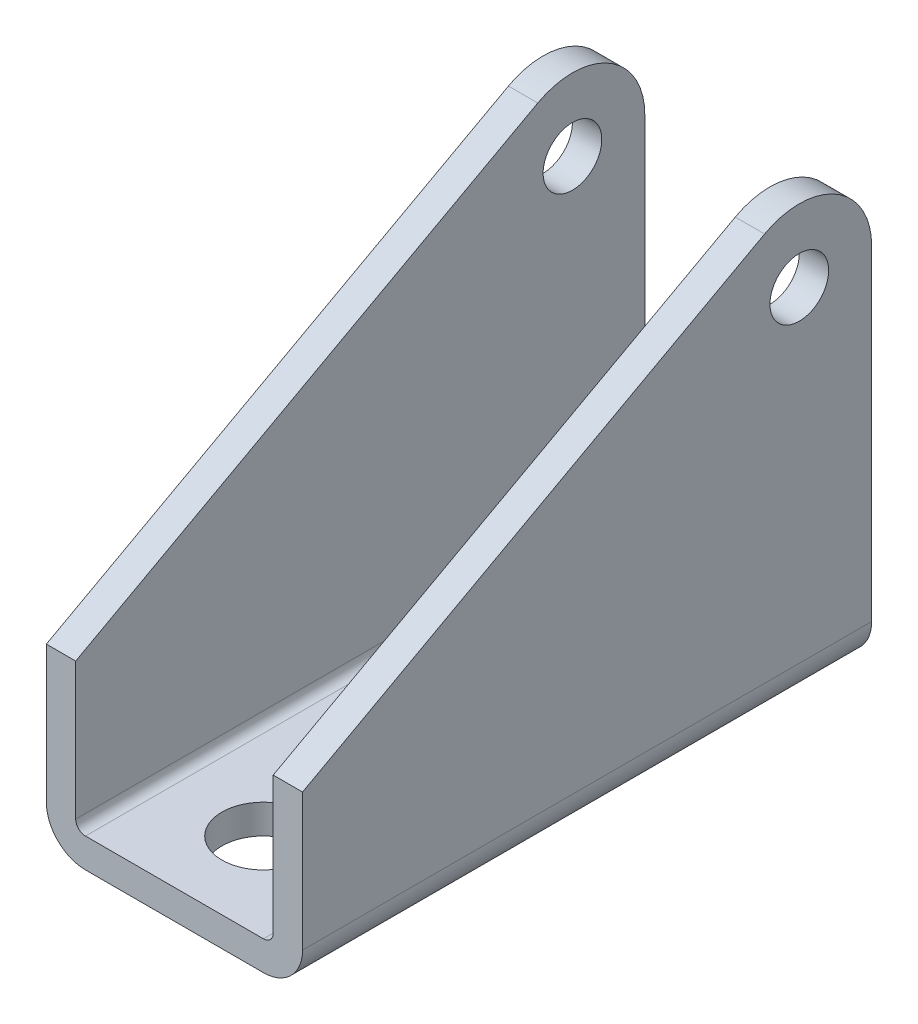
ISO-10303-21;
HEADER;
FILE_DESCRIPTION(('STEP AP214'),'2;1');
FILE_NAME('part.step','',(''),(''),'','','');
FILE_SCHEMA(('AUTOMOTIVE_DESIGN { 1 0 10303 214 1 1 1 1 }'));
ENDSEC;
DATA;
#1=APPLICATION_CONTEXT('core data for automotive mechanical design processes');
#2=APPLICATION_PROTOCOL_DEFINITION('international standard','automotive_design',2000,#1);
#3=PRODUCT_CONTEXT('',#1,'mechanical');
#4=PRODUCT('Part','Part','',(#3));
#5=PRODUCT_RELATED_PRODUCT_CATEGORY('part','',(#4));
#6=PRODUCT_DEFINITION_FORMATION('','',#4);
#7=PRODUCT_DEFINITION_CONTEXT('part definition',#1,'design');
#8=PRODUCT_DEFINITION('design','',#6,#7);
#9=PRODUCT_DEFINITION_SHAPE('','',#8);
#10=(LENGTH_UNIT() NAMED_UNIT(*) SI_UNIT(.MILLI.,.METRE.));
#11=(NAMED_UNIT(*) PLANE_ANGLE_UNIT() SI_UNIT($,.RADIAN.));
#12=(NAMED_UNIT(*) SI_UNIT($,.STERADIAN.) SOLID_ANGLE_UNIT());
#13=UNCERTAINTY_MEASURE_WITH_UNIT(LENGTH_MEASURE(1.E-05),#10,'distance_accuracy_value','');
#14=(GEOMETRIC_REPRESENTATION_CONTEXT(3) GLOBAL_UNCERTAINTY_ASSIGNED_CONTEXT((#13)) GLOBAL_UNIT_ASSIGNED_CONTEXT((#10,
#11,#12)) REPRESENTATION_CONTEXT('',''));
#15=CARTESIAN_POINT('',(0.,0.,0.));
#16=DIRECTION('',(0.,0.,1.));
#17=DIRECTION('',(1.,0.,0.));
#18=AXIS2_PLACEMENT_3D('',#15,#16,#17);
#19=CARTESIAN_POINT('',(0.,0.,0.));
#20=DIRECTION('',(0.,-1.,0.));
#21=DIRECTION('',(0.,0.,-1.));
#22=AXIS2_PLACEMENT_3D('',#19,#20,#21);
#23=PLANE('',#22);
#24=CARTESIAN_POINT('',(13.1,0.,-9.1));
#25=DIRECTION('',(0.,1.,0.));
#26=DIRECTION('',(-1.,0.,0.));
#27=AXIS2_PLACEMENT_3D('',#24,#25,#26);
#28=CIRCLE('',#27,4.25);
#29=CARTESIAN_POINT('',(17.35,0.,-9.1));
#30=VERTEX_POINT('',#29);
#31=EDGE_CURVE('E182',#30,#30,#28,.T.);
#32=ORIENTED_EDGE('',*,*,#31,.T.);
#33=EDGE_LOOP('',(#32));
#34=FACE_BOUND('',#33,.T.);
#35=DIRECTION('',(0.,0.,-1.));
#36=VECTOR('',#35,1.);
#37=CARTESIAN_POINT('',(17.6,0.,-29.1));
#38=LINE('',#37,#36);
#39=CARTESIAN_POINT('',(17.6,0.,-44.1));
#40=VERTEX_POINT('',#39);
#41=CARTESIAN_POINT('',(17.6,0.,-58.2));
#42=VERTEX_POINT('',#41);
#43=EDGE_CURVE('E201',#40,#42,#38,.T.);
#44=ORIENTED_EDGE('',*,*,#43,.T.);
#45=DIRECTION('',(1.,0.,0.));
#46=VECTOR('',#45,1.);
#47=CARTESIAN_POINT('',(0.,0.,-58.2));
#48=LINE('',#47,#46);
#49=CARTESIAN_POINT('',(22.2,0.,-58.2));
#50=VERTEX_POINT('',#49);
#51=EDGE_CURVE('E250',#42,#50,#48,.T.);
#52=ORIENTED_EDGE('',*,*,#51,.T.);
#53=DIRECTION('',(0.,0.,-1.));
#54=VECTOR('',#53,1.);
#55=CARTESIAN_POINT('',(22.2,0.,-16.0944996104437));
#56=LINE('',#55,#54);
#57=CARTESIAN_POINT('',(22.2,0.,0.));
#58=VERTEX_POINT('',#57);
#59=EDGE_CURVE('E25',#58,#50,#56,.T.);
#60=ORIENTED_EDGE('',*,*,#59,.F.);
#61=DIRECTION('',(1.,0.,0.));
#62=VECTOR('',#61,1.);
#63=CARTESIAN_POINT('',(0.,0.,0.));
#64=LINE('',#63,#62);
#65=CARTESIAN_POINT('',(4.,0.,0.));
#66=VERTEX_POINT('',#65);
#67=EDGE_CURVE('E308',#66,#58,#64,.T.);
#68=ORIENTED_EDGE('',*,*,#67,.F.);
#69=DIRECTION('',(0.,0.,1.));
#70=VECTOR('',#69,1.);
#71=CARTESIAN_POINT('',(4.,0.,-16.0944996104437));
#72=LINE('',#71,#70);
#73=CARTESIAN_POINT('',(4.,0.,-58.2));
#74=VERTEX_POINT('',#73);
#75=EDGE_CURVE('E110',#74,#66,#72,.T.);
#76=ORIENTED_EDGE('',*,*,#75,.F.);
#77=DIRECTION('',(1.,0.,0.));
#78=VECTOR('',#77,1.);
#79=CARTESIAN_POINT('',(0.,0.,-58.2));
#80=LINE('',#79,#78);
#81=CARTESIAN_POINT('',(8.6,0.,-58.2));
#82=VERTEX_POINT('',#81);
#83=EDGE_CURVE('E297',#74,#82,#80,.T.);
#84=ORIENTED_EDGE('',*,*,#83,.T.);
#85=DIRECTION('',(0.,0.,1.));
#86=VECTOR('',#85,1.);
#87=CARTESIAN_POINT('',(8.6,0.,-22.05));
#88=LINE('',#87,#86);
#89=CARTESIAN_POINT('',(8.6,0.,-44.1));
#90=VERTEX_POINT('',#89);
#91=EDGE_CURVE('E345',#82,#90,#88,.T.);
#92=ORIENTED_EDGE('',*,*,#91,.T.);
#93=CARTESIAN_POINT('',(13.1,0.,-44.1));
#94=DIRECTION('',(0.,1.,0.));
#95=DIRECTION('',(-1.,0.,0.));
#96=AXIS2_PLACEMENT_3D('',#93,#94,#95);
#97=CIRCLE('',#96,4.5);
#98=EDGE_CURVE('E181',#90,#40,#97,.T.);
#99=ORIENTED_EDGE('',*,*,#98,.T.);
#100=EDGE_LOOP('',(#44,#52,#60,#68,#76,#84,#92,#99));
#101=FACE_BOUND('',#100,.T.);
#102=ADVANCED_FACE('F15',(#34,#101),#23,.T.);
#103=CARTESIAN_POINT('',(0.,43.7952621476569,-47.2543590659492));
#104=DIRECTION('',(0.,0.877738128061736,0.479140666763613));
#105=DIRECTION('',(1.,0.,0.));
#106=AXIS2_PLACEMENT_3D('',#103,#104,#105);
#107=PLANE('',#106);
#108=DIRECTION('',(0.,0.479140666763613,-0.877738128061736));
#109=VECTOR('',#108,1.);
#110=CARTESIAN_POINT('',(23.2,46.200764646396,-51.6610008034429));
#111=LINE('',#110,#109);
#112=CARTESIAN_POINT('',(23.2,18.,0.));
#113=VERTEX_POINT('',#112);
#114=CARTESIAN_POINT('',(23.2,43.7952621476569,-47.2543590659492));
#115=VERTEX_POINT('',#114);
#116=EDGE_CURVE('E186',#113,#115,#111,.T.);
#117=ORIENTED_EDGE('',*,*,#116,.F.);
#118=DIRECTION('',(1.,0.,0.));
#119=VECTOR('',#118,1.);
#120=CARTESIAN_POINT('',(0.,18.,0.));
#121=LINE('',#120,#119);
#122=CARTESIAN_POINT('',(26.2,18.,0.));
#123=VERTEX_POINT('',#122);
#124=EDGE_CURVE('E222',#113,#123,#121,.T.);
#125=ORIENTED_EDGE('',*,*,#124,.T.);
#126=DIRECTION('',(0.,-0.479140666763613,0.877738128061736));
#127=VECTOR('',#126,1.);
#128=CARTESIAN_POINT('',(26.2,43.7952621476569,-47.2543590659492));
#129=LINE('',#128,#127);
#130=CARTESIAN_POINT('',(26.2,43.7952621476569,-47.2543590659492));
#131=VERTEX_POINT('',#130);
#132=EDGE_CURVE('E10',#131,#123,#129,.T.);
#133=ORIENTED_EDGE('',*,*,#132,.F.);
#134=DIRECTION('',(1.,0.,0.));
#135=VECTOR('',#134,1.);
#136=CARTESIAN_POINT('',(0.,43.7952621476569,-47.2543590659492));
#137=LINE('',#136,#135);
#138=EDGE_CURVE('E290',#115,#131,#137,.T.);
#139=ORIENTED_EDGE('',*,*,#138,.F.);
#140=EDGE_LOOP('',(#117,#125,#133,#139));
#141=FACE_BOUND('',#140,.T.);
#142=ADVANCED_FACE('F639',(#141),#107,.T.);
#143=CARTESIAN_POINT('',(26.2,16.8342705278706,-32.1889992208875));
#144=DIRECTION('',(1.,0.,0.));
#145=DIRECTION('',(0.,1.,0.));
#146=AXIS2_PLACEMENT_3D('',#143,#144,#145);
#147=PLANE('',#146);
#148=CARTESIAN_POINT('',(26.2,37.3,-50.8));
#149=DIRECTION('',(-1.,0.,0.));
#150=DIRECTION('',(0.,-1.,0.));
#151=AXIS2_PLACEMENT_3D('',#148,#149,#150);
#152=CIRCLE('',#151,3.);
#153=CARTESIAN_POINT('',(26.2,40.3,-50.8));
#154=VERTEX_POINT('',#153);
#155=EDGE_CURVE('E207',#154,#154,#152,.T.);
#156=ORIENTED_EDGE('',*,*,#155,.T.);
#157=EDGE_LOOP('',(#156));
#158=FACE_BOUND('',#157,.T.);
#159=DIRECTION('',(0.,0.,1.));
#160=VECTOR('',#159,1.);
#161=CARTESIAN_POINT('',(26.2,4.,-16.0944996104437));
#162=LINE('',#161,#160);
#163=CARTESIAN_POINT('',(26.2,4.,-58.2));
#164=VERTEX_POINT('',#163);
#165=CARTESIAN_POINT('',(26.2,4.,0.));
#166=VERTEX_POINT('',#165);
#167=EDGE_CURVE('E260',#164,#166,#162,.T.);
#168=ORIENTED_EDGE('',*,*,#167,.F.);
#169=DIRECTION('',(0.,1.,0.));
#170=VECTOR('',#169,1.);
#171=CARTESIAN_POINT('',(26.2,0.,-58.2));
#172=LINE('',#171,#170);
#173=CARTESIAN_POINT('',(26.2,37.3,-58.2));
#174=VERTEX_POINT('',#173);
#175=EDGE_CURVE('E304',#164,#174,#172,.T.);
#176=ORIENTED_EDGE('',*,*,#175,.T.);
#177=CARTESIAN_POINT('',(26.2,37.3,-50.8));
#178=DIRECTION('',(1.,0.,0.));
#179=DIRECTION('',(0.,0.,-1.));
#180=AXIS2_PLACEMENT_3D('',#177,#178,#179);
#181=CIRCLE('',#180,7.4);
#182=EDGE_CURVE('E210',#174,#131,#181,.T.);
#183=ORIENTED_EDGE('',*,*,#182,.T.);
#184=ORIENTED_EDGE('',*,*,#132,.T.);
#185=DIRECTION('',(0.,-1.,0.));
#186=VECTOR('',#185,1.);
#187=CARTESIAN_POINT('',(26.2,18.,0.));
#188=LINE('',#187,#186);
#189=EDGE_CURVE('E281',#123,#166,#188,.T.);
#190=ORIENTED_EDGE('',*,*,#189,.T.);
#191=EDGE_LOOP('',(#168,#176,#183,#184,#190));
#192=FACE_BOUND('',#191,.T.);
#193=ADVANCED_FACE('F644',(#158,#192),#147,.T.);
#194=CARTESIAN_POINT('',(22.2,4.,-16.0944996104437));
#195=DIRECTION('',(0.,0.,-1.));
#196=DIRECTION('',(0.707106781186547,-0.707106781186548,0.));
#197=AXIS2_PLACEMENT_3D('',#194,#195,#196);
#198=CYLINDRICAL_SURFACE('',#197,4.);
#199=CARTESIAN_POINT('',(22.2,4.,-58.2));
#200=DIRECTION('',(0.,0.,1.));
#201=DIRECTION('',(0.707106781186547,-0.707106781186548,0.));
#202=AXIS2_PLACEMENT_3D('',#199,#200,#201);
#203=CIRCLE('',#202,4.);
#204=EDGE_CURVE('E254',#50,#164,#203,.T.);
#205=ORIENTED_EDGE('',*,*,#204,.T.);
#206=ORIENTED_EDGE('',*,*,#167,.T.);
#207=CARTESIAN_POINT('',(22.2,4.,0.));
#208=DIRECTION('',(0.,0.,-1.));
#209=DIRECTION('',(0.707106781186547,-0.707106781186548,0.));
#210=AXIS2_PLACEMENT_3D('',#207,#208,#209);
#211=CIRCLE('',#210,4.);
#212=EDGE_CURVE('E285',#166,#58,#211,.T.);
#213=ORIENTED_EDGE('',*,*,#212,.T.);
#214=ORIENTED_EDGE('',*,*,#59,.T.);
#215=EDGE_LOOP('',(#205,#206,#213,#214));
#216=FACE_BOUND('',#215,.T.);
#217=ADVANCED_FACE('F688',(#216),#198,.T.);
#218=CARTESIAN_POINT('',(0.,16.8342705278706,-32.1889992208875));
#219=DIRECTION('',(1.,0.,0.));
#220=DIRECTION('',(0.,1.,0.));
#221=AXIS2_PLACEMENT_3D('',#218,#219,#220);
#222=PLANE('',#221);
#223=CARTESIAN_POINT('',(0.,37.3,-50.8));
#224=DIRECTION('',(1.,0.,0.));
#225=DIRECTION('',(0.,-1.,0.));
#226=AXIS2_PLACEMENT_3D('',#223,#224,#225);
#227=CIRCLE('',#226,3.);
#228=CARTESIAN_POINT('',(0.,40.3,-50.8));
#229=VERTEX_POINT('',#228);
#230=EDGE_CURVE('E37',#229,#229,#227,.T.);
#231=ORIENTED_EDGE('',*,*,#230,.T.);
#232=EDGE_LOOP('',(#231));
#233=FACE_BOUND('',#232,.T.);
#234=DIRECTION('',(0.,0.,-1.));
#235=VECTOR('',#234,1.);
#236=CARTESIAN_POINT('',(0.,4.,-16.0944996104437));
#237=LINE('',#236,#235);
#238=CARTESIAN_POINT('',(0.,4.,0.));
#239=VERTEX_POINT('',#238);
#240=CARTESIAN_POINT('',(0.,4.,-58.2));
#241=VERTEX_POINT('',#240);
#242=EDGE_CURVE('E98',#239,#241,#237,.T.);
#243=ORIENTED_EDGE('',*,*,#242,.F.);
#244=DIRECTION('',(0.,-1.,0.));
#245=VECTOR('',#244,1.);
#246=CARTESIAN_POINT('',(0.,18.,0.));
#247=LINE('',#246,#245);
#248=CARTESIAN_POINT('',(0.,18.,0.));
#249=VERTEX_POINT('',#248);
#250=EDGE_CURVE('E342',#249,#239,#247,.T.);
#251=ORIENTED_EDGE('',*,*,#250,.F.);
#252=DIRECTION('',(0.,-0.479140666763613,0.877738128061736));
#253=VECTOR('',#252,1.);
#254=CARTESIAN_POINT('',(0.,43.7952621476569,-47.2543590659492));
#255=LINE('',#254,#253);
#256=CARTESIAN_POINT('',(0.,43.7952621476569,-47.2543590659492));
#257=VERTEX_POINT('',#256);
#258=EDGE_CURVE('E221',#257,#249,#255,.T.);
#259=ORIENTED_EDGE('',*,*,#258,.F.);
#260=CARTESIAN_POINT('',(0.,37.3,-50.8));
#261=DIRECTION('',(1.,0.,0.));
#262=DIRECTION('',(0.,0.,-1.));
#263=AXIS2_PLACEMENT_3D('',#260,#261,#262);
#264=CIRCLE('',#263,7.4);
#265=CARTESIAN_POINT('',(0.,37.3,-58.2));
#266=VERTEX_POINT('',#265);
#267=EDGE_CURVE('E294',#266,#257,#264,.T.);
#268=ORIENTED_EDGE('',*,*,#267,.F.);
#269=DIRECTION('',(0.,1.,0.));
#270=VECTOR('',#269,1.);
#271=CARTESIAN_POINT('',(0.,0.,-58.2));
#272=LINE('',#271,#270);
#273=EDGE_CURVE('E266',#241,#266,#272,.T.);
#274=ORIENTED_EDGE('',*,*,#273,.F.);
#275=EDGE_LOOP('',(#243,#251,#259,#268,#274));
#276=FACE_BOUND('',#275,.T.);
#277=ADVANCED_FACE('F572',(#233,#276),#222,.F.);
#278=CARTESIAN_POINT('',(4.,4.,-16.0944996104437));
#279=DIRECTION('',(0.,0.,-1.));
#280=DIRECTION('',(-0.707106781186547,-0.707106781186548,0.));
#281=AXIS2_PLACEMENT_3D('',#278,#279,#280);
#282=CYLINDRICAL_SURFACE('',#281,4.);
#283=CARTESIAN_POINT('',(4.,4.,-58.2));
#284=DIRECTION('',(0.,0.,1.));
#285=DIRECTION('',(-0.707106781186547,-0.707106781186548,0.));
#286=AXIS2_PLACEMENT_3D('',#283,#284,#285);
#287=CIRCLE('',#286,4.);
#288=EDGE_CURVE('E295',#241,#74,#287,.T.);
#289=ORIENTED_EDGE('',*,*,#288,.T.);
#290=ORIENTED_EDGE('',*,*,#75,.T.);
#291=CARTESIAN_POINT('',(4.,4.,0.));
#292=DIRECTION('',(0.,0.,-1.));
#293=DIRECTION('',(-0.707106781186547,-0.707106781186548,0.));
#294=AXIS2_PLACEMENT_3D('',#291,#292,#293);
#295=CIRCLE('',#294,4.);
#296=EDGE_CURVE('E325',#66,#239,#295,.T.);
#297=ORIENTED_EDGE('',*,*,#296,.T.);
#298=ORIENTED_EDGE('',*,*,#242,.T.);
#299=EDGE_LOOP('',(#289,#290,#297,#298));
#300=FACE_BOUND('',#299,.T.);
#301=ADVANCED_FACE('F625',(#300),#282,.T.);
#302=CARTESIAN_POINT('',(0.,37.3,-50.8));
#303=DIRECTION('',(1.,0.,0.));
#304=DIRECTION('',(0.,-1.,0.));
#305=AXIS2_PLACEMENT_3D('',#302,#303,#304);
#306=CYLINDRICAL_SURFACE('',#305,3.);
#307=CARTESIAN_POINT('',(3.,37.3,-50.8));
#308=DIRECTION('',(-1.,0.,0.));
#309=DIRECTION('',(0.,-1.,0.));
#310=AXIS2_PLACEMENT_3D('',#307,#308,#309);
#311=CIRCLE('',#310,3.);
#312=CARTESIAN_POINT('',(3.,40.3,-50.8));
#313=VERTEX_POINT('',#312);
#314=EDGE_CURVE('E236',#313,#313,#311,.T.);
#315=ORIENTED_EDGE('',*,*,#314,.F.);
#316=EDGE_LOOP('',(#315));
#317=FACE_BOUND('',#316,.T.);
#318=ORIENTED_EDGE('',*,*,#230,.F.);
#319=EDGE_LOOP('',(#318));
#320=FACE_BOUND('',#319,.T.);
#321=ADVANCED_FACE('F621',(#317,#320),#306,.F.);
#322=CARTESIAN_POINT('',(0.,37.3,-50.8));
#323=DIRECTION('',(1.,0.,0.));
#324=DIRECTION('',(0.,-1.,0.));
#325=AXIS2_PLACEMENT_3D('',#322,#323,#324);
#326=CYLINDRICAL_SURFACE('',#325,3.);
#327=CARTESIAN_POINT('',(23.2,37.3,-50.8));
#328=DIRECTION('',(1.,0.,0.));
#329=DIRECTION('',(0.,-1.,0.));
#330=AXIS2_PLACEMENT_3D('',#327,#328,#329);
#331=CIRCLE('',#330,3.);
#332=CARTESIAN_POINT('',(23.2,40.3,-50.8));
#333=VERTEX_POINT('',#332);
#334=EDGE_CURVE('E175',#333,#333,#331,.T.);
#335=ORIENTED_EDGE('',*,*,#334,.F.);
#336=EDGE_LOOP('',(#335));
#337=FACE_BOUND('',#336,.T.);
#338=ORIENTED_EDGE('',*,*,#155,.F.);
#339=EDGE_LOOP('',(#338));
#340=FACE_BOUND('',#339,.T.);
#341=ADVANCED_FACE('F624',(#337,#340),#326,.F.);
#342=CARTESIAN_POINT('',(0.,37.3,-50.8));
#343=DIRECTION('',(1.,0.,0.));
#344=DIRECTION('',(0.,0.,-1.));
#345=AXIS2_PLACEMENT_3D('',#342,#343,#344);
#346=CYLINDRICAL_SURFACE('',#345,7.4);
#347=CARTESIAN_POINT('',(23.2,37.3,-50.8));
#348=DIRECTION('',(-1.,0.,0.));
#349=DIRECTION('',(0.,0.,-1.));
#350=AXIS2_PLACEMENT_3D('',#347,#348,#349);
#351=CIRCLE('',#350,7.4);
#352=CARTESIAN_POINT('',(23.2,37.3,-58.2));
#353=VERTEX_POINT('',#352);
#354=EDGE_CURVE('E176',#115,#353,#351,.T.);
#355=ORIENTED_EDGE('',*,*,#354,.F.);
#356=ORIENTED_EDGE('',*,*,#138,.T.);
#357=ORIENTED_EDGE('',*,*,#182,.F.);
#358=DIRECTION('',(1.,0.,0.));
#359=VECTOR('',#358,1.);
#360=CARTESIAN_POINT('',(0.,37.3,-58.2));
#361=LINE('',#360,#359);
#362=EDGE_CURVE('E248',#353,#174,#361,.T.);
#363=ORIENTED_EDGE('',*,*,#362,.F.);
#364=EDGE_LOOP('',(#355,#356,#357,#363));
#365=FACE_BOUND('',#364,.T.);
#366=ADVANCED_FACE('F632',(#365),#346,.T.);
#367=CARTESIAN_POINT('',(0.,37.3,-50.8));
#368=DIRECTION('',(1.,0.,0.));
#369=DIRECTION('',(0.,0.,-1.));
#370=AXIS2_PLACEMENT_3D('',#367,#368,#369);
#371=CYLINDRICAL_SURFACE('',#370,7.4);
#372=CARTESIAN_POINT('',(3.,37.3,-50.8));
#373=DIRECTION('',(1.,0.,0.));
#374=DIRECTION('',(0.,0.,-1.));
#375=AXIS2_PLACEMENT_3D('',#372,#373,#374);
#376=CIRCLE('',#375,7.4);
#377=CARTESIAN_POINT('',(3.,37.3,-58.2));
#378=VERTEX_POINT('',#377);
#379=CARTESIAN_POINT('',(3.,43.7952621476569,-47.2543590659492));
#380=VERTEX_POINT('',#379);
#381=EDGE_CURVE('E191',#378,#380,#376,.T.);
#382=ORIENTED_EDGE('',*,*,#381,.F.);
#383=DIRECTION('',(1.,0.,0.));
#384=VECTOR('',#383,1.);
#385=CARTESIAN_POINT('',(0.,37.3,-58.2));
#386=LINE('',#385,#384);
#387=EDGE_CURVE('E335',#266,#378,#386,.T.);
#388=ORIENTED_EDGE('',*,*,#387,.F.);
#389=ORIENTED_EDGE('',*,*,#267,.T.);
#390=DIRECTION('',(1.,0.,0.));
#391=VECTOR('',#390,1.);
#392=CARTESIAN_POINT('',(0.,43.7952621476569,-47.2543590659492));
#393=LINE('',#392,#391);
#394=EDGE_CURVE('E217',#257,#380,#393,.T.);
#395=ORIENTED_EDGE('',*,*,#394,.T.);
#396=EDGE_LOOP('',(#382,#388,#389,#395));
#397=FACE_BOUND('',#396,.T.);
#398=ADVANCED_FACE('F695',(#397),#371,.T.);
#399=CARTESIAN_POINT('',(0.,43.7952621476569,-47.2543590659492));
#400=DIRECTION('',(0.,0.877738128061736,0.479140666763613));
#401=DIRECTION('',(1.,0.,0.));
#402=AXIS2_PLACEMENT_3D('',#399,#400,#401);
#403=PLANE('',#402);
#404=DIRECTION('',(0.,-0.479140666763613,0.877738128061736));
#405=VECTOR('',#404,1.);
#406=CARTESIAN_POINT('',(3.,41.528897552971,-43.1026041538028));
#407=LINE('',#406,#405);
#408=CARTESIAN_POINT('',(3.,18.,0.));
#409=VERTEX_POINT('',#408);
#410=EDGE_CURVE('E228',#380,#409,#407,.T.);
#411=ORIENTED_EDGE('',*,*,#410,.F.);
#412=ORIENTED_EDGE('',*,*,#394,.F.);
#413=ORIENTED_EDGE('',*,*,#258,.T.);
#414=DIRECTION('',(1.,0.,0.));
#415=VECTOR('',#414,1.);
#416=CARTESIAN_POINT('',(0.,18.,0.));
#417=LINE('',#416,#415);
#418=EDGE_CURVE('E196',#249,#409,#417,.T.);
#419=ORIENTED_EDGE('',*,*,#418,.T.);
#420=EDGE_LOOP('',(#411,#412,#413,#419));
#421=FACE_BOUND('',#420,.T.);
#422=ADVANCED_FACE('F692',(#421),#403,.T.);
#423=CARTESIAN_POINT('',(0.,18.,0.));
#424=DIRECTION('',(0.,0.,1.));
#425=DIRECTION('',(1.,0.,0.));
#426=AXIS2_PLACEMENT_3D('',#423,#424,#425);
#427=PLANE('',#426);
#428=DIRECTION('',(0.,1.,0.));
#429=VECTOR('',#428,1.);
#430=CARTESIAN_POINT('',(23.2,31.35,0.));
#431=LINE('',#430,#429);
#432=CARTESIAN_POINT('',(23.2,4.,0.));
#433=VERTEX_POINT('',#432);
#434=EDGE_CURVE('E142',#433,#113,#431,.T.);
#435=ORIENTED_EDGE('',*,*,#434,.F.);
#436=CARTESIAN_POINT('',(22.2,4.,0.));
#437=DIRECTION('',(0.,0.,1.));
#438=DIRECTION('',(-1.,0.,0.));
#439=AXIS2_PLACEMENT_3D('',#436,#437,#438);
#440=CIRCLE('',#439,1.);
#441=CARTESIAN_POINT('',(22.2,3.,0.));
#442=VERTEX_POINT('',#441);
#443=EDGE_CURVE('E193',#442,#433,#440,.T.);
#444=ORIENTED_EDGE('',*,*,#443,.F.);
#445=DIRECTION('',(1.,0.,0.));
#446=VECTOR('',#445,1.);
#447=CARTESIAN_POINT('',(11.1,3.,0.));
#448=LINE('',#447,#446);
#449=CARTESIAN_POINT('',(4.,3.,0.));
#450=VERTEX_POINT('',#449);
#451=EDGE_CURVE('E138',#450,#442,#448,.T.);
#452=ORIENTED_EDGE('',*,*,#451,.F.);
#453=CARTESIAN_POINT('',(4.,4.,0.));
#454=DIRECTION('',(0.,0.,1.));
#455=DIRECTION('',(0.,1.,0.));
#456=AXIS2_PLACEMENT_3D('',#453,#454,#455);
#457=CIRCLE('',#456,1.);
#458=CARTESIAN_POINT('',(3.,4.,0.));
#459=VERTEX_POINT('',#458);
#460=EDGE_CURVE('E18',#459,#450,#457,.T.);
#461=ORIENTED_EDGE('',*,*,#460,.F.);
#462=DIRECTION('',(0.,-1.,0.));
#463=VECTOR('',#462,1.);
#464=CARTESIAN_POINT('',(3.,11.,0.));
#465=LINE('',#464,#463);
#466=EDGE_CURVE('E192',#409,#459,#465,.T.);
#467=ORIENTED_EDGE('',*,*,#466,.F.);
#468=ORIENTED_EDGE('',*,*,#418,.F.);
#469=ORIENTED_EDGE('',*,*,#250,.T.);
#470=ORIENTED_EDGE('',*,*,#296,.F.);
#471=ORIENTED_EDGE('',*,*,#67,.T.);
#472=ORIENTED_EDGE('',*,*,#212,.F.);
#473=ORIENTED_EDGE('',*,*,#189,.F.);
#474=ORIENTED_EDGE('',*,*,#124,.F.);
#475=EDGE_LOOP('',(#435,#444,#452,#461,#467,#468,#469,#470,#471,#472,#473,#474));
#476=FACE_BOUND('',#475,.T.);
#477=ADVANCED_FACE('F394',(#476),#427,.T.);
#478=CARTESIAN_POINT('',(22.2,4.,-58.2));
#479=DIRECTION('',(0.,0.,1.));
#480=DIRECTION('',(-1.,0.,0.));
#481=AXIS2_PLACEMENT_3D('',#478,#479,#480);
#482=CYLINDRICAL_SURFACE('',#481,1.);
#483=ORIENTED_EDGE('',*,*,#443,.T.);
#484=DIRECTION('',(0.,0.,1.));
#485=VECTOR('',#484,1.);
#486=CARTESIAN_POINT('',(23.2,4.,-58.2));
#487=LINE('',#486,#485);
#488=CARTESIAN_POINT('',(23.2,4.,-58.2));
#489=VERTEX_POINT('',#488);
#490=EDGE_CURVE('E148',#489,#433,#487,.T.);
#491=ORIENTED_EDGE('',*,*,#490,.F.);
#492=CARTESIAN_POINT('',(22.2,4.,-58.2));
#493=DIRECTION('',(0.,0.,-1.));
#494=DIRECTION('',(-1.,0.,0.));
#495=AXIS2_PLACEMENT_3D('',#492,#493,#494);
#496=CIRCLE('',#495,1.);
#497=CARTESIAN_POINT('',(22.2,3.,-58.2));
#498=VERTEX_POINT('',#497);
#499=EDGE_CURVE('E145',#489,#498,#496,.T.);
#500=ORIENTED_EDGE('',*,*,#499,.T.);
#501=DIRECTION('',(0.,0.,1.));
#502=VECTOR('',#501,1.);
#503=CARTESIAN_POINT('',(22.2,3.,-58.2));
#504=LINE('',#503,#502);
#505=EDGE_CURVE('E128',#498,#442,#504,.T.);
#506=ORIENTED_EDGE('',*,*,#505,.T.);
#507=EDGE_LOOP('',(#483,#491,#500,#506));
#508=FACE_BOUND('',#507,.T.);
#509=ADVANCED_FACE('F146',(#508),#482,.F.);
#510=CARTESIAN_POINT('',(4.,4.,-58.2));
#511=DIRECTION('',(0.,0.,1.));
#512=DIRECTION('',(0.,1.,0.));
#513=AXIS2_PLACEMENT_3D('',#510,#511,#512);
#514=CYLINDRICAL_SURFACE('',#513,1.);
#515=ORIENTED_EDGE('',*,*,#460,.T.);
#516=DIRECTION('',(0.,0.,1.));
#517=VECTOR('',#516,1.);
#518=CARTESIAN_POINT('',(4.,3.,-58.2));
#519=LINE('',#518,#517);
#520=CARTESIAN_POINT('',(4.,3.,-58.2));
#521=VERTEX_POINT('',#520);
#522=EDGE_CURVE('E253',#521,#450,#519,.T.);
#523=ORIENTED_EDGE('',*,*,#522,.F.);
#524=CARTESIAN_POINT('',(4.,4.,-58.2));
#525=DIRECTION('',(0.,0.,-1.));
#526=DIRECTION('',(0.,1.,0.));
#527=AXIS2_PLACEMENT_3D('',#524,#525,#526);
#528=CIRCLE('',#527,1.);
#529=CARTESIAN_POINT('',(3.,4.,-58.2));
#530=VERTEX_POINT('',#529);
#531=EDGE_CURVE('E168',#521,#530,#528,.T.);
#532=ORIENTED_EDGE('',*,*,#531,.T.);
#533=DIRECTION('',(0.,0.,1.));
#534=VECTOR('',#533,1.);
#535=CARTESIAN_POINT('',(3.,4.,-58.2));
#536=LINE('',#535,#534);
#537=EDGE_CURVE('E187',#530,#459,#536,.T.);
#538=ORIENTED_EDGE('',*,*,#537,.T.);
#539=EDGE_LOOP('',(#515,#523,#532,#538));
#540=FACE_BOUND('',#539,.T.);
#541=ADVANCED_FACE('F385',(#540),#514,.F.);
#542=CARTESIAN_POINT('',(3.,4.,-58.2));
#543=DIRECTION('',(1.,0.,0.));
#544=DIRECTION('',(0.,1.,0.));
#545=AXIS2_PLACEMENT_3D('',#542,#543,#544);
#546=PLANE('',#545);
#547=ORIENTED_EDGE('',*,*,#314,.T.);
#548=EDGE_LOOP('',(#547));
#549=FACE_BOUND('',#548,.T.);
#550=ORIENTED_EDGE('',*,*,#466,.T.);
#551=ORIENTED_EDGE('',*,*,#537,.F.);
#552=DIRECTION('',(0.,1.,0.));
#553=VECTOR('',#552,1.);
#554=CARTESIAN_POINT('',(3.,2.,-58.2));
#555=LINE('',#554,#553);
#556=EDGE_CURVE('E339',#530,#378,#555,.T.);
#557=ORIENTED_EDGE('',*,*,#556,.T.);
#558=ORIENTED_EDGE('',*,*,#381,.T.);
#559=ORIENTED_EDGE('',*,*,#410,.T.);
#560=EDGE_LOOP('',(#550,#551,#557,#558,#559));
#561=FACE_BOUND('',#560,.T.);
#562=ADVANCED_FACE('F389',(#549,#561),#546,.T.);
#563=CARTESIAN_POINT('',(23.2,44.7,-58.2));
#564=DIRECTION('',(-1.,0.,0.));
#565=DIRECTION('',(0.,1.,0.));
#566=AXIS2_PLACEMENT_3D('',#563,#564,#565);
#567=PLANE('',#566);
#568=ORIENTED_EDGE('',*,*,#334,.T.);
#569=EDGE_LOOP('',(#568));
#570=FACE_BOUND('',#569,.T.);
#571=ORIENTED_EDGE('',*,*,#434,.T.);
#572=ORIENTED_EDGE('',*,*,#116,.T.);
#573=ORIENTED_EDGE('',*,*,#354,.T.);
#574=DIRECTION('',(0.,-1.,0.));
#575=VECTOR('',#574,1.);
#576=CARTESIAN_POINT('',(23.2,22.35,-58.2));
#577=LINE('',#576,#575);
#578=EDGE_CURVE('E153',#353,#489,#577,.T.);
#579=ORIENTED_EDGE('',*,*,#578,.T.);
#580=ORIENTED_EDGE('',*,*,#490,.T.);
#581=EDGE_LOOP('',(#571,#572,#573,#579,#580));
#582=FACE_BOUND('',#581,.T.);
#583=ADVANCED_FACE('F697',(#570,#582),#567,.T.);
#584=CARTESIAN_POINT('',(22.2,3.,-58.2));
#585=DIRECTION('',(0.,1.,0.));
#586=DIRECTION('',(0.,0.,-1.));
#587=AXIS2_PLACEMENT_3D('',#584,#585,#586);
#588=PLANE('',#587);
#589=CARTESIAN_POINT('',(13.1,3.,-9.1));
#590=DIRECTION('',(0.,-1.,0.));
#591=DIRECTION('',(-1.,0.,0.));
#592=AXIS2_PLACEMENT_3D('',#589,#590,#591);
#593=CIRCLE('',#592,4.25);
#594=CARTESIAN_POINT('',(17.35,3.,-9.1));
#595=VERTEX_POINT('',#594);
#596=EDGE_CURVE('E177',#595,#595,#593,.T.);
#597=ORIENTED_EDGE('',*,*,#596,.T.);
#598=EDGE_LOOP('',(#597));
#599=FACE_BOUND('',#598,.T.);
#600=DIRECTION('',(0.,0.,1.));
#601=VECTOR('',#600,1.);
#602=CARTESIAN_POINT('',(17.6,3.,-58.2));
#603=LINE('',#602,#601);
#604=CARTESIAN_POINT('',(17.6,3.,-58.2));
#605=VERTEX_POINT('',#604);
#606=CARTESIAN_POINT('',(17.6,3.,-44.1));
#607=VERTEX_POINT('',#606);
#608=EDGE_CURVE('E225',#605,#607,#603,.T.);
#609=ORIENTED_EDGE('',*,*,#608,.T.);
#610=CARTESIAN_POINT('',(13.1,3.,-44.1));
#611=DIRECTION('',(0.,-1.,0.));
#612=DIRECTION('',(-1.,0.,0.));
#613=AXIS2_PLACEMENT_3D('',#610,#611,#612);
#614=CIRCLE('',#613,4.5);
#615=CARTESIAN_POINT('',(8.6,3.,-44.1));
#616=VERTEX_POINT('',#615);
#617=EDGE_CURVE('E202',#607,#616,#614,.T.);
#618=ORIENTED_EDGE('',*,*,#617,.T.);
#619=DIRECTION('',(0.,0.,-1.));
#620=VECTOR('',#619,1.);
#621=CARTESIAN_POINT('',(8.6,3.,-51.15));
#622=LINE('',#621,#620);
#623=CARTESIAN_POINT('',(8.6,3.,-58.2));
#624=VERTEX_POINT('',#623);
#625=EDGE_CURVE('E309',#616,#624,#622,.T.);
#626=ORIENTED_EDGE('',*,*,#625,.T.);
#627=DIRECTION('',(-1.,0.,0.));
#628=VECTOR('',#627,1.);
#629=CARTESIAN_POINT('',(11.1,3.,-58.2));
#630=LINE('',#629,#628);
#631=EDGE_CURVE('E161',#624,#521,#630,.T.);
#632=ORIENTED_EDGE('',*,*,#631,.T.);
#633=ORIENTED_EDGE('',*,*,#522,.T.);
#634=ORIENTED_EDGE('',*,*,#451,.T.);
#635=ORIENTED_EDGE('',*,*,#505,.F.);
#636=DIRECTION('',(-1.,0.,0.));
#637=VECTOR('',#636,1.);
#638=CARTESIAN_POINT('',(11.1,3.,-58.2));
#639=LINE('',#638,#637);
#640=EDGE_CURVE('E134',#498,#605,#639,.T.);
#641=ORIENTED_EDGE('',*,*,#640,.T.);
#642=EDGE_LOOP('',(#609,#618,#626,#632,#633,#634,#635,#641));
#643=FACE_BOUND('',#642,.T.);
#644=ADVANCED_FACE('F131',(#599,#643),#588,.T.);
#645=CARTESIAN_POINT('',(0.,0.,-58.2));
#646=DIRECTION('',(0.,0.,-1.));
#647=DIRECTION('',(-1.,0.,0.));
#648=AXIS2_PLACEMENT_3D('',#645,#646,#647);
#649=PLANE('',#648);
#650=DIRECTION('',(0.,1.,0.));
#651=VECTOR('',#650,1.);
#652=CARTESIAN_POINT('',(17.6,1.5,-58.2));
#653=LINE('',#652,#651);
#654=EDGE_CURVE('E158',#42,#605,#653,.T.);
#655=ORIENTED_EDGE('',*,*,#654,.T.);
#656=ORIENTED_EDGE('',*,*,#640,.F.);
#657=ORIENTED_EDGE('',*,*,#499,.F.);
#658=ORIENTED_EDGE('',*,*,#578,.F.);
#659=ORIENTED_EDGE('',*,*,#362,.T.);
#660=ORIENTED_EDGE('',*,*,#175,.F.);
#661=ORIENTED_EDGE('',*,*,#204,.F.);
#662=ORIENTED_EDGE('',*,*,#51,.F.);
#663=EDGE_LOOP('',(#655,#656,#657,#658,#659,#660,#661,#662));
#664=FACE_BOUND('',#663,.T.);
#665=ADVANCED_FACE('F155',(#664),#649,.T.);
#666=CARTESIAN_POINT('',(0.,0.,-58.2));
#667=DIRECTION('',(0.,0.,-1.));
#668=DIRECTION('',(-1.,0.,0.));
#669=AXIS2_PLACEMENT_3D('',#666,#667,#668);
#670=PLANE('',#669);
#671=DIRECTION('',(0.,-1.,0.));
#672=VECTOR('',#671,1.);
#673=CARTESIAN_POINT('',(8.6,3.,-58.2));
#674=LINE('',#673,#672);
#675=EDGE_CURVE('E313',#624,#82,#674,.T.);
#676=ORIENTED_EDGE('',*,*,#675,.T.);
#677=ORIENTED_EDGE('',*,*,#83,.F.);
#678=ORIENTED_EDGE('',*,*,#288,.F.);
#679=ORIENTED_EDGE('',*,*,#273,.T.);
#680=ORIENTED_EDGE('',*,*,#387,.T.);
#681=ORIENTED_EDGE('',*,*,#556,.F.);
#682=ORIENTED_EDGE('',*,*,#531,.F.);
#683=ORIENTED_EDGE('',*,*,#631,.F.);
#684=EDGE_LOOP('',(#676,#677,#678,#679,#680,#681,#682,#683));
#685=FACE_BOUND('',#684,.T.);
#686=ADVANCED_FACE('F386',(#685),#670,.T.);
#687=CARTESIAN_POINT('',(8.6,3.,-44.1));
#688=DIRECTION('',(-1.,0.,0.));
#689=DIRECTION('',(0.,0.,1.));
#690=AXIS2_PLACEMENT_3D('',#687,#688,#689);
#691=PLANE('',#690);
#692=ORIENTED_EDGE('',*,*,#91,.F.);
#693=ORIENTED_EDGE('',*,*,#675,.F.);
#694=ORIENTED_EDGE('',*,*,#625,.F.);
#695=DIRECTION('',(0.,-1.,0.));
#696=VECTOR('',#695,1.);
#697=CARTESIAN_POINT('',(8.6,3.,-44.1));
#698=LINE('',#697,#696);
#699=EDGE_CURVE('E206',#616,#90,#698,.T.);
#700=ORIENTED_EDGE('',*,*,#699,.T.);
#701=EDGE_LOOP('',(#692,#693,#694,#700));
#702=FACE_BOUND('',#701,.T.);
#703=ADVANCED_FACE('F706',(#702),#691,.F.);
#704=CARTESIAN_POINT('',(17.6,3.,-58.2));
#705=DIRECTION('',(1.,0.,0.));
#706=DIRECTION('',(0.,1.,0.));
#707=AXIS2_PLACEMENT_3D('',#704,#705,#706);
#708=PLANE('',#707);
#709=ORIENTED_EDGE('',*,*,#43,.F.);
#710=DIRECTION('',(0.,-1.,0.));
#711=VECTOR('',#710,1.);
#712=CARTESIAN_POINT('',(17.6,3.,-44.1));
#713=LINE('',#712,#711);
#714=EDGE_CURVE('E197',#607,#40,#713,.T.);
#715=ORIENTED_EDGE('',*,*,#714,.F.);
#716=ORIENTED_EDGE('',*,*,#608,.F.);
#717=ORIENTED_EDGE('',*,*,#654,.F.);
#718=EDGE_LOOP('',(#709,#715,#716,#717));
#719=FACE_BOUND('',#718,.T.);
#720=ADVANCED_FACE('F653',(#719),#708,.F.);
#721=CARTESIAN_POINT('',(13.1,3.,-44.1));
#722=DIRECTION('',(0.,-1.,0.));
#723=DIRECTION('',(-1.,0.,0.));
#724=AXIS2_PLACEMENT_3D('',#721,#722,#723);
#725=CYLINDRICAL_SURFACE('',#724,4.5);
#726=ORIENTED_EDGE('',*,*,#98,.F.);
#727=ORIENTED_EDGE('',*,*,#699,.F.);
#728=ORIENTED_EDGE('',*,*,#617,.F.);
#729=ORIENTED_EDGE('',*,*,#714,.T.);
#730=EDGE_LOOP('',(#726,#727,#728,#729));
#731=FACE_BOUND('',#730,.T.);
#732=ADVANCED_FACE('F658',(#731),#725,.F.);
#733=CARTESIAN_POINT('',(13.1,3.,-9.1));
#734=DIRECTION('',(0.,-1.,0.));
#735=DIRECTION('',(-1.,0.,0.));
#736=AXIS2_PLACEMENT_3D('',#733,#734,#735);
#737=CYLINDRICAL_SURFACE('',#736,4.25);
#738=ORIENTED_EDGE('',*,*,#596,.F.);
#739=EDGE_LOOP('',(#738));
#740=FACE_BOUND('',#739,.T.);
#741=ORIENTED_EDGE('',*,*,#31,.F.);
#742=EDGE_LOOP('',(#741));
#743=FACE_BOUND('',#742,.T.);
#744=ADVANCED_FACE('F679',(#740,#743),#737,.F.);
#745=CLOSED_SHELL('',(#102,#142,#193,#217,#277,#301,#321,#341,#366,#398,#422,#477,#509,#541,
#562,#583,#644,#665,#686,#703,#720,#732,#744));
#746=MANIFOLD_SOLID_BREP('B1',#745);
#747=ADVANCED_BREP_SHAPE_REPRESENTATION('',(#18,#746),#14);
#748=SHAPE_DEFINITION_REPRESENTATION(#9,#747);
ENDSEC;
END-ISO-10303-21;
